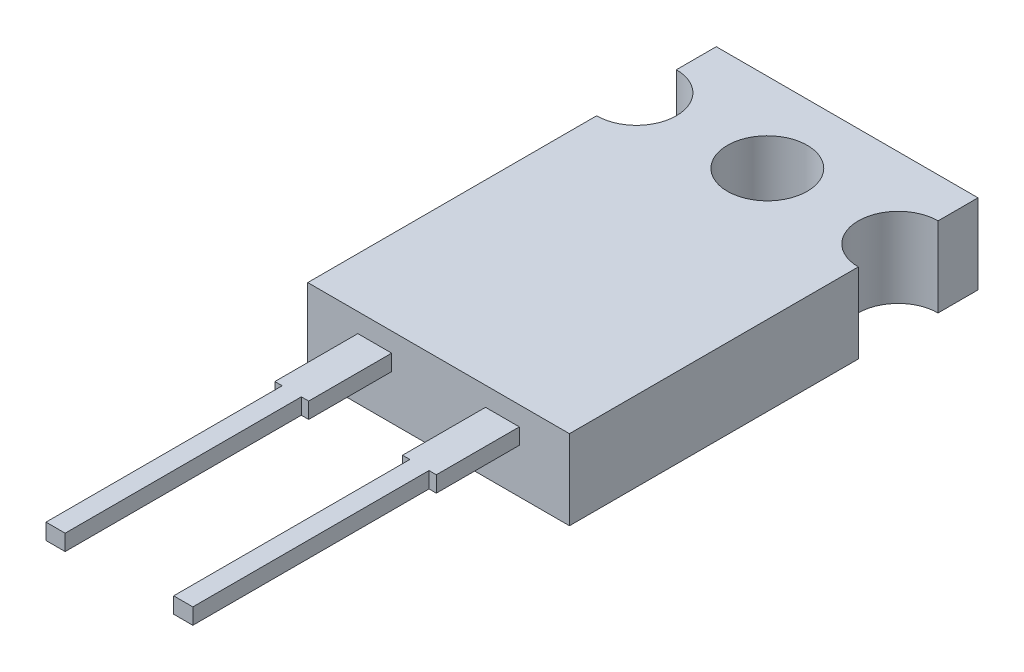
ISO-10303-21;
HEADER;
FILE_DESCRIPTION(('STEP AP214'),'2;1');
FILE_NAME('part.step','',(''),(''),'','','');
FILE_SCHEMA(('AUTOMOTIVE_DESIGN { 1 0 10303 214 1 1 1 1 }'));
ENDSEC;
DATA;
#1=APPLICATION_CONTEXT('core data for automotive mechanical design processes');
#2=APPLICATION_PROTOCOL_DEFINITION('international standard','automotive_design',2000,#1);
#3=PRODUCT_CONTEXT('',#1,'mechanical');
#4=PRODUCT('Part','Part','',(#3));
#5=PRODUCT_RELATED_PRODUCT_CATEGORY('part','',(#4));
#6=PRODUCT_DEFINITION_FORMATION('','',#4);
#7=PRODUCT_DEFINITION_CONTEXT('part definition',#1,'design');
#8=PRODUCT_DEFINITION('design','',#6,#7);
#9=PRODUCT_DEFINITION_SHAPE('','',#8);
#10=(LENGTH_UNIT() NAMED_UNIT(*) SI_UNIT(.MILLI.,.METRE.));
#11=(NAMED_UNIT(*) PLANE_ANGLE_UNIT() SI_UNIT($,.RADIAN.));
#12=(NAMED_UNIT(*) SI_UNIT($,.STERADIAN.) SOLID_ANGLE_UNIT());
#13=UNCERTAINTY_MEASURE_WITH_UNIT(LENGTH_MEASURE(1.E-05),#10,'distance_accuracy_value','');
#14=(GEOMETRIC_REPRESENTATION_CONTEXT(3) GLOBAL_UNCERTAINTY_ASSIGNED_CONTEXT((#13)) GLOBAL_UNIT_ASSIGNED_CONTEXT((#10,
#11,#12)) REPRESENTATION_CONTEXT('',''));
#15=CARTESIAN_POINT('',(0.,0.,0.));
#16=DIRECTION('',(0.,0.,1.));
#17=DIRECTION('',(1.,0.,0.));
#18=AXIS2_PLACEMENT_3D('',#15,#16,#17);
#19=CARTESIAN_POINT('',(0.,3.175,0.));
#20=DIRECTION('',(0.,0.,-1.));
#21=DIRECTION('',(-1.,0.,0.));
#22=AXIS2_PLACEMENT_3D('',#19,#20,#21);
#23=PLANE('',#22);
#24=DIRECTION('',(0.,1.,0.));
#25=VECTOR('',#24,1.);
#26=CARTESIAN_POINT('',(8.4201,1.778,0.));
#27=LINE('',#26,#25);
#28=CARTESIAN_POINT('',(8.4201,1.778,0.));
#29=VERTEX_POINT('',#28);
#30=CARTESIAN_POINT('',(8.4201,2.413,0.));
#31=VERTEX_POINT('',#30);
#32=EDGE_CURVE('E265',#29,#31,#27,.T.);
#33=ORIENTED_EDGE('',*,*,#32,.F.);
#34=DIRECTION('',(1.,0.,0.));
#35=VECTOR('',#34,1.);
#36=CARTESIAN_POINT('',(8.4201,1.778,0.));
#37=LINE('',#36,#35);
#38=CARTESIAN_POINT('',(7.0739,1.778,0.));
#39=VERTEX_POINT('',#38);
#40=EDGE_CURVE('E271',#39,#29,#37,.T.);
#41=ORIENTED_EDGE('',*,*,#40,.F.);
#42=DIRECTION('',(0.,-1.,0.));
#43=VECTOR('',#42,1.);
#44=CARTESIAN_POINT('',(7.0739,1.778,0.));
#45=LINE('',#44,#43);
#46=CARTESIAN_POINT('',(7.0739,2.413,0.));
#47=VERTEX_POINT('',#46);
#48=EDGE_CURVE('E283',#47,#39,#45,.T.);
#49=ORIENTED_EDGE('',*,*,#48,.F.);
#50=DIRECTION('',(-1.,0.,0.));
#51=VECTOR('',#50,1.);
#52=CARTESIAN_POINT('',(8.4201,2.413,0.));
#53=LINE('',#52,#51);
#54=EDGE_CURVE('E279',#31,#47,#53,.T.);
#55=ORIENTED_EDGE('',*,*,#54,.F.);
#56=EDGE_LOOP('',(#33,#41,#49,#55));
#57=FACE_BOUND('',#56,.T.);
#58=DIRECTION('',(1.,0.,0.));
#59=VECTOR('',#58,1.);
#60=CARTESIAN_POINT('',(0.,0.,0.));
#61=LINE('',#60,#59);
#62=CARTESIAN_POINT('',(0.,0.,0.));
#63=VERTEX_POINT('',#62);
#64=CARTESIAN_POINT('',(10.414,0.,0.));
#65=VERTEX_POINT('',#64);
#66=EDGE_CURVE('E333',#63,#65,#61,.T.);
#67=ORIENTED_EDGE('',*,*,#66,.T.);
#68=DIRECTION('',(0.,-1.,0.));
#69=VECTOR('',#68,1.);
#70=CARTESIAN_POINT('',(10.414,3.175,0.));
#71=LINE('',#70,#69);
#72=CARTESIAN_POINT('',(10.414,3.175,0.));
#73=VERTEX_POINT('',#72);
#74=EDGE_CURVE('E380',#73,#65,#71,.T.);
#75=ORIENTED_EDGE('',*,*,#74,.F.);
#76=DIRECTION('',(1.,0.,0.));
#77=VECTOR('',#76,1.);
#78=CARTESIAN_POINT('',(0.,3.175,0.));
#79=LINE('',#78,#77);
#80=CARTESIAN_POINT('',(0.,3.175,0.));
#81=VERTEX_POINT('',#80);
#82=EDGE_CURVE('E334',#81,#73,#79,.T.);
#83=ORIENTED_EDGE('',*,*,#82,.F.);
#84=DIRECTION('',(0.,-1.,0.));
#85=VECTOR('',#84,1.);
#86=CARTESIAN_POINT('',(0.,3.175,0.));
#87=LINE('',#86,#85);
#88=EDGE_CURVE('E353',#81,#63,#87,.T.);
#89=ORIENTED_EDGE('',*,*,#88,.T.);
#90=EDGE_LOOP('',(#67,#75,#83,#89));
#91=FACE_BOUND('',#90,.T.);
#92=DIRECTION('',(0.,1.,0.));
#93=VECTOR('',#92,1.);
#94=CARTESIAN_POINT('',(3.3401,1.778,0.));
#95=LINE('',#94,#93);
#96=CARTESIAN_POINT('',(3.3401,1.778,0.));
#97=VERTEX_POINT('',#96);
#98=CARTESIAN_POINT('',(3.3401,2.413,0.));
#99=VERTEX_POINT('',#98);
#100=EDGE_CURVE('E243',#97,#99,#95,.T.);
#101=ORIENTED_EDGE('',*,*,#100,.F.);
#102=DIRECTION('',(1.,0.,0.));
#103=VECTOR('',#102,1.);
#104=CARTESIAN_POINT('',(3.3401,1.778,0.));
#105=LINE('',#104,#103);
#106=CARTESIAN_POINT('',(1.9939,1.778,0.));
#107=VERTEX_POINT('',#106);
#108=EDGE_CURVE('E231',#107,#97,#105,.T.);
#109=ORIENTED_EDGE('',*,*,#108,.F.);
#110=DIRECTION('',(0.,-1.,0.));
#111=VECTOR('',#110,1.);
#112=CARTESIAN_POINT('',(1.9939,1.778,0.));
#113=LINE('',#112,#111);
#114=CARTESIAN_POINT('',(1.9939,2.413,0.));
#115=VERTEX_POINT('',#114);
#116=EDGE_CURVE('E238',#115,#107,#113,.T.);
#117=ORIENTED_EDGE('',*,*,#116,.F.);
#118=DIRECTION('',(-1.,0.,0.));
#119=VECTOR('',#118,1.);
#120=CARTESIAN_POINT('',(3.3401,2.413,0.));
#121=LINE('',#120,#119);
#122=EDGE_CURVE('E247',#99,#115,#121,.T.);
#123=ORIENTED_EDGE('',*,*,#122,.F.);
#124=EDGE_LOOP('',(#101,#109,#117,#123));
#125=FACE_BOUND('',#124,.T.);
#126=ADVANCED_FACE('F39',(#57,#91,#125),#23,.F.);
#127=CARTESIAN_POINT('',(10.414,3.175,0.));
#128=DIRECTION('',(-1.,0.,0.));
#129=DIRECTION('',(0.,0.,1.));
#130=AXIS2_PLACEMENT_3D('',#127,#128,#129);
#131=PLANE('',#130);
#132=DIRECTION('',(0.,0.,-1.));
#133=VECTOR('',#132,1.);
#134=CARTESIAN_POINT('',(10.414,0.,0.));
#135=LINE('',#134,#133);
#136=CARTESIAN_POINT('',(10.414,0.,-11.4935));
#137=VERTEX_POINT('',#136);
#138=EDGE_CURVE('E358',#65,#137,#135,.T.);
#139=ORIENTED_EDGE('',*,*,#138,.T.);
#140=DIRECTION('',(0.,1.,0.));
#141=VECTOR('',#140,1.);
#142=CARTESIAN_POINT('',(10.414,0.,-11.4935));
#143=LINE('',#142,#141);
#144=CARTESIAN_POINT('',(10.414,3.175,-11.4935));
#145=VERTEX_POINT('',#144);
#146=EDGE_CURVE('E323',#137,#145,#143,.T.);
#147=ORIENTED_EDGE('',*,*,#146,.T.);
#148=DIRECTION('',(0.,0.,-1.));
#149=VECTOR('',#148,1.);
#150=CARTESIAN_POINT('',(10.414,3.175,0.));
#151=LINE('',#150,#149);
#152=EDGE_CURVE('E340',#73,#145,#151,.T.);
#153=ORIENTED_EDGE('',*,*,#152,.F.);
#154=ORIENTED_EDGE('',*,*,#74,.T.);
#155=EDGE_LOOP('',(#139,#147,#153,#154));
#156=FACE_BOUND('',#155,.T.);
#157=ADVANCED_FACE('F488',(#156),#131,.F.);
#158=CARTESIAN_POINT('',(0.,3.175,0.));
#159=DIRECTION('',(-1.,0.,0.));
#160=DIRECTION('',(0.,0.,1.));
#161=AXIS2_PLACEMENT_3D('',#158,#159,#160);
#162=PLANE('',#161);
#163=DIRECTION('',(0.,1.,0.));
#164=VECTOR('',#163,1.);
#165=CARTESIAN_POINT('',(0.,0.,-11.4935));
#166=LINE('',#165,#164);
#167=CARTESIAN_POINT('',(0.,0.,-11.4935));
#168=VERTEX_POINT('',#167);
#169=CARTESIAN_POINT('',(0.,3.175,-11.4935));
#170=VERTEX_POINT('',#169);
#171=EDGE_CURVE('E330',#168,#170,#166,.T.);
#172=ORIENTED_EDGE('',*,*,#171,.F.);
#173=DIRECTION('',(0.,0.,-1.));
#174=VECTOR('',#173,1.);
#175=CARTESIAN_POINT('',(0.,0.,0.));
#176=LINE('',#175,#174);
#177=EDGE_CURVE('E339',#63,#168,#176,.T.);
#178=ORIENTED_EDGE('',*,*,#177,.F.);
#179=ORIENTED_EDGE('',*,*,#88,.F.);
#180=DIRECTION('',(0.,0.,-1.));
#181=VECTOR('',#180,1.);
#182=CARTESIAN_POINT('',(0.,3.175,0.));
#183=LINE('',#182,#181);
#184=EDGE_CURVE('E349',#81,#170,#183,.T.);
#185=ORIENTED_EDGE('',*,*,#184,.T.);
#186=EDGE_LOOP('',(#172,#178,#179,#185));
#187=FACE_BOUND('',#186,.T.);
#188=ADVANCED_FACE('F492',(#187),#162,.T.);
#189=CARTESIAN_POINT('',(10.414,3.175,-14.6685));
#190=VERTEX_POINT('',#189);
#191=CARTESIAN_POINT('',(10.414,3.175,-16.256));
#192=VERTEX_POINT('',#191);
#193=EDGE_CURVE('E338',#190,#192,#151,.T.);
#194=ORIENTED_EDGE('',*,*,#193,.F.);
#195=DIRECTION('',(0.,1.,0.));
#196=VECTOR('',#195,1.);
#197=CARTESIAN_POINT('',(10.414,0.,-14.6685));
#198=LINE('',#197,#196);
#199=CARTESIAN_POINT('',(10.414,0.,-14.6685));
#200=VERTEX_POINT('',#199);
#201=EDGE_CURVE('E316',#190,#200,#198,.F.);
#202=ORIENTED_EDGE('',*,*,#201,.T.);
#203=CARTESIAN_POINT('',(10.414,0.,-16.256));
#204=VERTEX_POINT('',#203);
#205=EDGE_CURVE('E357',#200,#204,#135,.T.);
#206=ORIENTED_EDGE('',*,*,#205,.T.);
#207=DIRECTION('',(0.,-1.,0.));
#208=VECTOR('',#207,1.);
#209=CARTESIAN_POINT('',(10.414,3.175,-16.256));
#210=LINE('',#209,#208);
#211=EDGE_CURVE('E376',#192,#204,#210,.T.);
#212=ORIENTED_EDGE('',*,*,#211,.F.);
#213=EDGE_LOOP('',(#194,#202,#206,#212));
#214=FACE_BOUND('',#213,.T.);
#215=ADVANCED_FACE('F494',(#214),#131,.F.);
#216=CARTESIAN_POINT('',(0.,3.175,-16.256));
#217=DIRECTION('',(0.,0.,-1.));
#218=DIRECTION('',(-1.,0.,0.));
#219=AXIS2_PLACEMENT_3D('',#216,#217,#218);
#220=PLANE('',#219);
#221=DIRECTION('',(1.,0.,0.));
#222=VECTOR('',#221,1.);
#223=CARTESIAN_POINT('',(0.,0.,-16.256));
#224=LINE('',#223,#222);
#225=CARTESIAN_POINT('',(0.,0.,-16.256));
#226=VERTEX_POINT('',#225);
#227=EDGE_CURVE('E362',#226,#204,#224,.T.);
#228=ORIENTED_EDGE('',*,*,#227,.F.);
#229=DIRECTION('',(0.,-1.,0.));
#230=VECTOR('',#229,1.);
#231=CARTESIAN_POINT('',(0.,3.175,-16.256));
#232=LINE('',#231,#230);
#233=CARTESIAN_POINT('',(0.,3.175,-16.256));
#234=VERTEX_POINT('',#233);
#235=EDGE_CURVE('E372',#234,#226,#232,.T.);
#236=ORIENTED_EDGE('',*,*,#235,.F.);
#237=DIRECTION('',(1.,0.,0.));
#238=VECTOR('',#237,1.);
#239=CARTESIAN_POINT('',(0.,3.175,-16.256));
#240=LINE('',#239,#238);
#241=EDGE_CURVE('E344',#234,#192,#240,.T.);
#242=ORIENTED_EDGE('',*,*,#241,.T.);
#243=ORIENTED_EDGE('',*,*,#211,.T.);
#244=EDGE_LOOP('',(#228,#236,#242,#243));
#245=FACE_BOUND('',#244,.T.);
#246=ADVANCED_FACE('F503',(#245),#220,.T.);
#247=DIRECTION('',(0.,1.,0.));
#248=VECTOR('',#247,1.);
#249=CARTESIAN_POINT('',(0.,0.,-14.6685));
#250=LINE('',#249,#248);
#251=CARTESIAN_POINT('',(0.,3.175,-14.6685));
#252=VERTEX_POINT('',#251);
#253=CARTESIAN_POINT('',(0.,0.,-14.6685));
#254=VERTEX_POINT('',#253);
#255=EDGE_CURVE('E327',#252,#254,#250,.F.);
#256=ORIENTED_EDGE('',*,*,#255,.F.);
#257=EDGE_CURVE('E348',#252,#234,#183,.T.);
#258=ORIENTED_EDGE('',*,*,#257,.T.);
#259=ORIENTED_EDGE('',*,*,#235,.T.);
#260=EDGE_CURVE('E366',#254,#226,#176,.T.);
#261=ORIENTED_EDGE('',*,*,#260,.F.);
#262=EDGE_LOOP('',(#256,#258,#259,#261));
#263=FACE_BOUND('',#262,.T.);
#264=ADVANCED_FACE('F500',(#263),#162,.T.);
#265=CARTESIAN_POINT('',(0.,3.175,0.));
#266=DIRECTION('',(0.,1.,0.));
#267=DIRECTION('',(0.,0.,1.));
#268=AXIS2_PLACEMENT_3D('',#265,#266,#267);
#269=PLANE('',#268);
#270=CARTESIAN_POINT('',(0.,3.175,-13.081));
#271=DIRECTION('',(0.,1.,0.));
#272=DIRECTION('',(0.,0.,1.));
#273=AXIS2_PLACEMENT_3D('',#270,#271,#272);
#274=CIRCLE('',#273,1.5875);
#275=EDGE_CURVE('E301',#170,#252,#274,.T.);
#276=ORIENTED_EDGE('',*,*,#275,.F.);
#277=ORIENTED_EDGE('',*,*,#184,.F.);
#278=ORIENTED_EDGE('',*,*,#82,.T.);
#279=ORIENTED_EDGE('',*,*,#152,.T.);
#280=CARTESIAN_POINT('',(10.414,3.175,-13.081));
#281=DIRECTION('',(0.,1.,0.));
#282=DIRECTION('',(0.,0.,1.));
#283=AXIS2_PLACEMENT_3D('',#280,#281,#282);
#284=CIRCLE('',#283,1.5875);
#285=EDGE_CURVE('E302',#190,#145,#284,.T.);
#286=ORIENTED_EDGE('',*,*,#285,.F.);
#287=ORIENTED_EDGE('',*,*,#193,.T.);
#288=ORIENTED_EDGE('',*,*,#241,.F.);
#289=ORIENTED_EDGE('',*,*,#257,.F.);
#290=EDGE_LOOP('',(#276,#277,#278,#279,#286,#287,#288,#289));
#291=FACE_BOUND('',#290,.T.);
#292=CARTESIAN_POINT('',(5.207,3.175,-13.081));
#293=DIRECTION('',(0.,1.,0.));
#294=DIRECTION('',(0.,0.,1.));
#295=AXIS2_PLACEMENT_3D('',#292,#293,#294);
#296=CIRCLE('',#295,1.5875);
#297=CARTESIAN_POINT('',(5.207,3.175,-11.4935));
#298=VERTEX_POINT('',#297);
#299=EDGE_CURVE('E305',#298,#298,#296,.T.);
#300=ORIENTED_EDGE('',*,*,#299,.F.);
#301=EDGE_LOOP('',(#300));
#302=FACE_BOUND('',#301,.T.);
#303=ADVANCED_FACE('F527',(#291,#302),#269,.T.);
#304=CARTESIAN_POINT('',(0.,0.,0.));
#305=DIRECTION('',(0.,1.,0.));
#306=DIRECTION('',(0.,0.,1.));
#307=AXIS2_PLACEMENT_3D('',#304,#305,#306);
#308=PLANE('',#307);
#309=CARTESIAN_POINT('',(5.207,0.,-13.081));
#310=DIRECTION('',(0.,1.,0.));
#311=DIRECTION('',(0.,0.,1.));
#312=AXIS2_PLACEMENT_3D('',#309,#310,#311);
#313=CIRCLE('',#312,1.5875);
#314=CARTESIAN_POINT('',(5.207,0.,-11.4935));
#315=VERTEX_POINT('',#314);
#316=EDGE_CURVE('E312',#315,#315,#313,.T.);
#317=ORIENTED_EDGE('',*,*,#316,.T.);
#318=EDGE_LOOP('',(#317));
#319=FACE_BOUND('',#318,.T.);
#320=ORIENTED_EDGE('',*,*,#177,.T.);
#321=CARTESIAN_POINT('',(0.,0.,-13.081));
#322=DIRECTION('',(0.,1.,0.));
#323=DIRECTION('',(0.,0.,1.));
#324=AXIS2_PLACEMENT_3D('',#321,#322,#323);
#325=CIRCLE('',#324,1.5875);
#326=EDGE_CURVE('E306',#168,#254,#325,.T.);
#327=ORIENTED_EDGE('',*,*,#326,.T.);
#328=ORIENTED_EDGE('',*,*,#260,.T.);
#329=ORIENTED_EDGE('',*,*,#227,.T.);
#330=ORIENTED_EDGE('',*,*,#205,.F.);
#331=CARTESIAN_POINT('',(10.414,0.,-13.081));
#332=DIRECTION('',(0.,1.,0.));
#333=DIRECTION('',(0.,0.,1.));
#334=AXIS2_PLACEMENT_3D('',#331,#332,#333);
#335=CIRCLE('',#334,1.5875);
#336=EDGE_CURVE('E384',#200,#137,#335,.T.);
#337=ORIENTED_EDGE('',*,*,#336,.T.);
#338=ORIENTED_EDGE('',*,*,#138,.F.);
#339=ORIENTED_EDGE('',*,*,#66,.F.);
#340=EDGE_LOOP('',(#320,#327,#328,#329,#330,#337,#338,#339));
#341=FACE_BOUND('',#340,.T.);
#342=ADVANCED_FACE('F521',(#319,#341),#308,.F.);
#343=CARTESIAN_POINT('',(5.207,0.,-13.081));
#344=DIRECTION('',(0.,1.,0.));
#345=DIRECTION('',(0.,0.,1.));
#346=AXIS2_PLACEMENT_3D('',#343,#344,#345);
#347=CYLINDRICAL_SURFACE('',#346,1.5875);
#348=ORIENTED_EDGE('',*,*,#316,.F.);
#349=EDGE_LOOP('',(#348));
#350=FACE_BOUND('',#349,.T.);
#351=ORIENTED_EDGE('',*,*,#299,.T.);
#352=EDGE_LOOP('',(#351));
#353=FACE_BOUND('',#352,.T.);
#354=ADVANCED_FACE('F542',(#350,#353),#347,.F.);
#355=CARTESIAN_POINT('',(10.414,0.,-13.081));
#356=DIRECTION('',(0.,1.,0.));
#357=DIRECTION('',(0.,0.,1.));
#358=AXIS2_PLACEMENT_3D('',#355,#356,#357);
#359=CYLINDRICAL_SURFACE('',#358,1.5875);
#360=ORIENTED_EDGE('',*,*,#336,.F.);
#361=ORIENTED_EDGE('',*,*,#201,.F.);
#362=ORIENTED_EDGE('',*,*,#285,.T.);
#363=ORIENTED_EDGE('',*,*,#146,.F.);
#364=EDGE_LOOP('',(#360,#361,#362,#363));
#365=FACE_BOUND('',#364,.T.);
#366=ADVANCED_FACE('F539',(#365),#359,.F.);
#367=CARTESIAN_POINT('',(0.,0.,-13.081));
#368=DIRECTION('',(0.,1.,0.));
#369=DIRECTION('',(0.,0.,1.));
#370=AXIS2_PLACEMENT_3D('',#367,#368,#369);
#371=CYLINDRICAL_SURFACE('',#370,1.5875);
#372=ORIENTED_EDGE('',*,*,#171,.T.);
#373=ORIENTED_EDGE('',*,*,#275,.T.);
#374=ORIENTED_EDGE('',*,*,#255,.T.);
#375=ORIENTED_EDGE('',*,*,#326,.F.);
#376=EDGE_LOOP('',(#372,#373,#374,#375));
#377=FACE_BOUND('',#376,.T.);
#378=ADVANCED_FACE('F541',(#377),#371,.F.);
#379=CARTESIAN_POINT('',(8.4201,1.778,12.7));
#380=DIRECTION('',(-1.,0.,0.));
#381=DIRECTION('',(0.,0.,1.));
#382=AXIS2_PLACEMENT_3D('',#379,#380,#381);
#383=PLANE('',#382);
#384=DIRECTION('',(0.,0.,-1.));
#385=VECTOR('',#384,1.);
#386=CARTESIAN_POINT('',(8.4201,2.413,12.7));
#387=LINE('',#386,#385);
#388=CARTESIAN_POINT('',(8.4201,2.413,3.302));
#389=VERTEX_POINT('',#388);
#390=EDGE_CURVE('E298',#389,#31,#387,.T.);
#391=ORIENTED_EDGE('',*,*,#390,.F.);
#392=DIRECTION('',(0.,1.,0.));
#393=VECTOR('',#392,1.);
#394=CARTESIAN_POINT('',(8.4201,0.,3.302));
#395=LINE('',#394,#393);
#396=CARTESIAN_POINT('',(8.4201,1.778,3.302));
#397=VERTEX_POINT('',#396);
#398=EDGE_CURVE('E415',#397,#389,#395,.T.);
#399=ORIENTED_EDGE('',*,*,#398,.F.);
#400=DIRECTION('',(0.,0.,-1.));
#401=VECTOR('',#400,1.);
#402=CARTESIAN_POINT('',(8.4201,1.778,12.7));
#403=LINE('',#402,#401);
#404=EDGE_CURVE('E275',#397,#29,#403,.T.);
#405=ORIENTED_EDGE('',*,*,#404,.T.);
#406=ORIENTED_EDGE('',*,*,#32,.T.);
#407=EDGE_LOOP('',(#391,#399,#405,#406));
#408=FACE_BOUND('',#407,.T.);
#409=ADVANCED_FACE('F420',(#408),#383,.F.);
#410=CARTESIAN_POINT('',(8.4201,2.413,12.7));
#411=DIRECTION('',(0.,-1.,0.));
#412=DIRECTION('',(1.,0.,0.));
#413=AXIS2_PLACEMENT_3D('',#410,#411,#412);
#414=PLANE('',#413);
#415=DIRECTION('',(0.,0.,-1.));
#416=VECTOR('',#415,1.);
#417=CARTESIAN_POINT('',(7.0739,2.413,12.7));
#418=LINE('',#417,#416);
#419=CARTESIAN_POINT('',(7.0739,2.413,3.302));
#420=VERTEX_POINT('',#419);
#421=EDGE_CURVE('E295',#420,#47,#418,.T.);
#422=ORIENTED_EDGE('',*,*,#421,.F.);
#423=DIRECTION('',(-1.,0.,0.));
#424=VECTOR('',#423,1.);
#425=CARTESIAN_POINT('',(7.0739,2.413,3.302));
#426=LINE('',#425,#424);
#427=CARTESIAN_POINT('',(7.366,2.413,3.302));
#428=VERTEX_POINT('',#427);
#429=EDGE_CURVE('E450',#428,#420,#426,.T.);
#430=ORIENTED_EDGE('',*,*,#429,.F.);
#431=DIRECTION('',(0.,0.,-1.));
#432=VECTOR('',#431,1.);
#433=CARTESIAN_POINT('',(7.366,2.413,12.7));
#434=LINE('',#433,#432);
#435=CARTESIAN_POINT('',(7.366,2.413,12.7));
#436=VERTEX_POINT('',#435);
#437=EDGE_CURVE('E426',#436,#428,#434,.T.);
#438=ORIENTED_EDGE('',*,*,#437,.F.);
#439=DIRECTION('',(-1.,0.,0.));
#440=VECTOR('',#439,1.);
#441=CARTESIAN_POINT('',(8.4201,2.413,12.7));
#442=LINE('',#441,#440);
#443=CARTESIAN_POINT('',(8.128,2.413,12.7));
#444=VERTEX_POINT('',#443);
#445=EDGE_CURVE('E266',#444,#436,#442,.T.);
#446=ORIENTED_EDGE('',*,*,#445,.F.);
#447=DIRECTION('',(0.,0.,1.));
#448=VECTOR('',#447,1.);
#449=CARTESIAN_POINT('',(8.128,2.413,12.7));
#450=LINE('',#449,#448);
#451=CARTESIAN_POINT('',(8.128,2.413,3.302));
#452=VERTEX_POINT('',#451);
#453=EDGE_CURVE('E62',#452,#444,#450,.T.);
#454=ORIENTED_EDGE('',*,*,#453,.F.);
#455=DIRECTION('',(-1.,0.,0.));
#456=VECTOR('',#455,1.);
#457=CARTESIAN_POINT('',(8.4201,2.413,3.302));
#458=LINE('',#457,#456);
#459=EDGE_CURVE('E428',#389,#452,#458,.T.);
#460=ORIENTED_EDGE('',*,*,#459,.F.);
#461=ORIENTED_EDGE('',*,*,#390,.T.);
#462=ORIENTED_EDGE('',*,*,#54,.T.);
#463=EDGE_LOOP('',(#422,#430,#438,#446,#454,#460,#461,#462));
#464=FACE_BOUND('',#463,.T.);
#465=ADVANCED_FACE('F449',(#464),#414,.F.);
#466=CARTESIAN_POINT('',(7.0739,1.778,12.7));
#467=DIRECTION('',(1.,0.,0.));
#468=DIRECTION('',(0.,0.,-1.));
#469=AXIS2_PLACEMENT_3D('',#466,#467,#468);
#470=PLANE('',#469);
#471=DIRECTION('',(0.,0.,-1.));
#472=VECTOR('',#471,1.);
#473=CARTESIAN_POINT('',(7.0739,1.778,12.7));
#474=LINE('',#473,#472);
#475=CARTESIAN_POINT('',(7.0739,1.778,3.302));
#476=VERTEX_POINT('',#475);
#477=EDGE_CURVE('E292',#476,#39,#474,.T.);
#478=ORIENTED_EDGE('',*,*,#477,.F.);
#479=DIRECTION('',(0.,1.,0.));
#480=VECTOR('',#479,1.);
#481=CARTESIAN_POINT('',(7.0739,0.,3.302));
#482=LINE('',#481,#480);
#483=EDGE_CURVE('E460',#476,#420,#482,.T.);
#484=ORIENTED_EDGE('',*,*,#483,.T.);
#485=ORIENTED_EDGE('',*,*,#421,.T.);
#486=ORIENTED_EDGE('',*,*,#48,.T.);
#487=EDGE_LOOP('',(#478,#484,#485,#486));
#488=FACE_BOUND('',#487,.T.);
#489=ADVANCED_FACE('F474',(#488),#470,.F.);
#490=CARTESIAN_POINT('',(8.4201,1.778,12.7));
#491=DIRECTION('',(0.,1.,0.));
#492=DIRECTION('',(-1.,0.,0.));
#493=AXIS2_PLACEMENT_3D('',#490,#491,#492);
#494=PLANE('',#493);
#495=DIRECTION('',(0.,0.,-1.));
#496=VECTOR('',#495,1.);
#497=CARTESIAN_POINT('',(7.366,1.778,12.7));
#498=LINE('',#497,#496);
#499=CARTESIAN_POINT('',(7.366,1.778,12.7));
#500=VERTEX_POINT('',#499);
#501=CARTESIAN_POINT('',(7.366,1.778,3.302));
#502=VERTEX_POINT('',#501);
#503=EDGE_CURVE('E54',#500,#502,#498,.T.);
#504=ORIENTED_EDGE('',*,*,#503,.T.);
#505=DIRECTION('',(-1.,0.,0.));
#506=VECTOR('',#505,1.);
#507=CARTESIAN_POINT('',(8.4201,1.778,3.302));
#508=LINE('',#507,#506);
#509=EDGE_CURVE('E11',#502,#476,#508,.T.);
#510=ORIENTED_EDGE('',*,*,#509,.T.);
#511=ORIENTED_EDGE('',*,*,#477,.T.);
#512=ORIENTED_EDGE('',*,*,#40,.T.);
#513=ORIENTED_EDGE('',*,*,#404,.F.);
#514=DIRECTION('',(-1.,0.,0.));
#515=VECTOR('',#514,1.);
#516=CARTESIAN_POINT('',(8.4201,1.778,3.302));
#517=LINE('',#516,#515);
#518=CARTESIAN_POINT('',(8.128,1.778,3.302));
#519=VERTEX_POINT('',#518);
#520=EDGE_CURVE('E47',#397,#519,#517,.T.);
#521=ORIENTED_EDGE('',*,*,#520,.T.);
#522=DIRECTION('',(0.,0.,1.));
#523=VECTOR('',#522,1.);
#524=CARTESIAN_POINT('',(8.128,1.778,12.7));
#525=LINE('',#524,#523);
#526=CARTESIAN_POINT('',(8.128,1.778,12.7));
#527=VERTEX_POINT('',#526);
#528=EDGE_CURVE('E409',#519,#527,#525,.T.);
#529=ORIENTED_EDGE('',*,*,#528,.T.);
#530=DIRECTION('',(1.,0.,0.));
#531=VECTOR('',#530,1.);
#532=CARTESIAN_POINT('',(8.4201,1.778,12.7));
#533=LINE('',#532,#531);
#534=EDGE_CURVE('E270',#500,#527,#533,.T.);
#535=ORIENTED_EDGE('',*,*,#534,.F.);
#536=EDGE_LOOP('',(#504,#510,#511,#512,#513,#521,#529,#535));
#537=FACE_BOUND('',#536,.T.);
#538=ADVANCED_FACE('F407',(#537),#494,.F.);
#539=CARTESIAN_POINT('',(0.,0.,12.7));
#540=DIRECTION('',(0.,0.,1.));
#541=DIRECTION('',(1.,0.,0.));
#542=AXIS2_PLACEMENT_3D('',#539,#540,#541);
#543=PLANE('',#542);
#544=DIRECTION('',(0.,1.,0.));
#545=VECTOR('',#544,1.);
#546=CARTESIAN_POINT('',(7.366,0.,12.7));
#547=LINE('',#546,#545);
#548=EDGE_CURVE('E400',#500,#436,#547,.T.);
#549=ORIENTED_EDGE('',*,*,#548,.F.);
#550=ORIENTED_EDGE('',*,*,#534,.T.);
#551=DIRECTION('',(0.,-1.,0.));
#552=VECTOR('',#551,1.);
#553=CARTESIAN_POINT('',(8.128,0.,12.7));
#554=LINE('',#553,#552);
#555=EDGE_CURVE('E397',#444,#527,#554,.T.);
#556=ORIENTED_EDGE('',*,*,#555,.F.);
#557=ORIENTED_EDGE('',*,*,#445,.T.);
#558=EDGE_LOOP('',(#549,#550,#556,#557));
#559=FACE_BOUND('',#558,.T.);
#560=ADVANCED_FACE('F441',(#559),#543,.T.);
#561=CARTESIAN_POINT('',(3.3401,1.778,12.7));
#562=DIRECTION('',(-1.,0.,0.));
#563=DIRECTION('',(0.,0.,1.));
#564=AXIS2_PLACEMENT_3D('',#561,#562,#563);
#565=PLANE('',#564);
#566=DIRECTION('',(0.,0.,-1.));
#567=VECTOR('',#566,1.);
#568=CARTESIAN_POINT('',(3.3401,2.413,12.7));
#569=LINE('',#568,#567);
#570=CARTESIAN_POINT('',(3.3401,2.413,3.302));
#571=VERTEX_POINT('',#570);
#572=EDGE_CURVE('E262',#571,#99,#569,.T.);
#573=ORIENTED_EDGE('',*,*,#572,.F.);
#574=DIRECTION('',(0.,1.,0.));
#575=VECTOR('',#574,1.);
#576=CARTESIAN_POINT('',(3.3401,0.,3.302));
#577=LINE('',#576,#575);
#578=CARTESIAN_POINT('',(3.3401,1.778,3.302));
#579=VERTEX_POINT('',#578);
#580=EDGE_CURVE('E457',#579,#571,#577,.T.);
#581=ORIENTED_EDGE('',*,*,#580,.F.);
#582=DIRECTION('',(0.,0.,-1.));
#583=VECTOR('',#582,1.);
#584=CARTESIAN_POINT('',(3.3401,1.778,12.7));
#585=LINE('',#584,#583);
#586=EDGE_CURVE('E235',#579,#97,#585,.T.);
#587=ORIENTED_EDGE('',*,*,#586,.T.);
#588=ORIENTED_EDGE('',*,*,#100,.T.);
#589=EDGE_LOOP('',(#573,#581,#587,#588));
#590=FACE_BOUND('',#589,.T.);
#591=ADVANCED_FACE('F629',(#590),#565,.F.);
#592=CARTESIAN_POINT('',(3.3401,2.413,12.7));
#593=DIRECTION('',(0.,-1.,0.));
#594=DIRECTION('',(1.,0.,0.));
#595=AXIS2_PLACEMENT_3D('',#592,#593,#594);
#596=PLANE('',#595);
#597=DIRECTION('',(0.,0.,-1.));
#598=VECTOR('',#597,1.);
#599=CARTESIAN_POINT('',(1.9939,2.413,12.7));
#600=LINE('',#599,#598);
#601=CARTESIAN_POINT('',(1.9939,2.413,3.302));
#602=VERTEX_POINT('',#601);
#603=EDGE_CURVE('E259',#602,#115,#600,.T.);
#604=ORIENTED_EDGE('',*,*,#603,.F.);
#605=DIRECTION('',(-1.,0.,0.));
#606=VECTOR('',#605,1.);
#607=CARTESIAN_POINT('',(1.9939,2.413,3.302));
#608=LINE('',#607,#606);
#609=CARTESIAN_POINT('',(2.286,2.413,3.302));
#610=VERTEX_POINT('',#609);
#611=EDGE_CURVE('E223',#610,#602,#608,.T.);
#612=ORIENTED_EDGE('',*,*,#611,.F.);
#613=DIRECTION('',(0.,0.,-1.));
#614=VECTOR('',#613,1.);
#615=CARTESIAN_POINT('',(2.286,2.413,12.7));
#616=LINE('',#615,#614);
#617=CARTESIAN_POINT('',(2.286,2.413,12.7));
#618=VERTEX_POINT('',#617);
#619=EDGE_CURVE('E205',#618,#610,#616,.T.);
#620=ORIENTED_EDGE('',*,*,#619,.F.);
#621=DIRECTION('',(-1.,0.,0.));
#622=VECTOR('',#621,1.);
#623=CARTESIAN_POINT('',(3.3401,2.413,12.7));
#624=LINE('',#623,#622);
#625=CARTESIAN_POINT('',(3.048,2.413,12.7));
#626=VERTEX_POINT('',#625);
#627=EDGE_CURVE('E222',#626,#618,#624,.T.);
#628=ORIENTED_EDGE('',*,*,#627,.F.);
#629=DIRECTION('',(0.,0.,1.));
#630=VECTOR('',#629,1.);
#631=CARTESIAN_POINT('',(3.048,2.413,12.7));
#632=LINE('',#631,#630);
#633=CARTESIAN_POINT('',(3.048,2.413,3.302));
#634=VERTEX_POINT('',#633);
#635=EDGE_CURVE('E751',#634,#626,#632,.T.);
#636=ORIENTED_EDGE('',*,*,#635,.F.);
#637=DIRECTION('',(-1.,0.,0.));
#638=VECTOR('',#637,1.);
#639=CARTESIAN_POINT('',(3.3401,2.413,3.302));
#640=LINE('',#639,#638);
#641=EDGE_CURVE('E464',#571,#634,#640,.T.);
#642=ORIENTED_EDGE('',*,*,#641,.F.);
#643=ORIENTED_EDGE('',*,*,#572,.T.);
#644=ORIENTED_EDGE('',*,*,#122,.T.);
#645=EDGE_LOOP('',(#604,#612,#620,#628,#636,#642,#643,#644));
#646=FACE_BOUND('',#645,.T.);
#647=ADVANCED_FACE('F220',(#646),#596,.F.);
#648=CARTESIAN_POINT('',(1.9939,1.778,12.7));
#649=DIRECTION('',(1.,0.,0.));
#650=DIRECTION('',(0.,0.,-1.));
#651=AXIS2_PLACEMENT_3D('',#648,#649,#650);
#652=PLANE('',#651);
#653=DIRECTION('',(0.,0.,-1.));
#654=VECTOR('',#653,1.);
#655=CARTESIAN_POINT('',(1.9939,1.778,12.7));
#656=LINE('',#655,#654);
#657=CARTESIAN_POINT('',(1.9939,1.778,3.302));
#658=VERTEX_POINT('',#657);
#659=EDGE_CURVE('E256',#658,#107,#656,.T.);
#660=ORIENTED_EDGE('',*,*,#659,.F.);
#661=DIRECTION('',(0.,1.,0.));
#662=VECTOR('',#661,1.);
#663=CARTESIAN_POINT('',(1.9939,0.,3.302));
#664=LINE('',#663,#662);
#665=EDGE_CURVE('E435',#658,#602,#664,.T.);
#666=ORIENTED_EDGE('',*,*,#665,.T.);
#667=ORIENTED_EDGE('',*,*,#603,.T.);
#668=ORIENTED_EDGE('',*,*,#116,.T.);
#669=EDGE_LOOP('',(#660,#666,#667,#668));
#670=FACE_BOUND('',#669,.T.);
#671=ADVANCED_FACE('F647',(#670),#652,.F.);
#672=CARTESIAN_POINT('',(3.3401,1.778,12.7));
#673=DIRECTION('',(0.,1.,0.));
#674=DIRECTION('',(-1.,0.,0.));
#675=AXIS2_PLACEMENT_3D('',#672,#673,#674);
#676=PLANE('',#675);
#677=DIRECTION('',(0.,0.,-1.));
#678=VECTOR('',#677,1.);
#679=CARTESIAN_POINT('',(2.286,1.778,12.7));
#680=LINE('',#679,#678);
#681=CARTESIAN_POINT('',(2.286,1.778,12.7));
#682=VERTEX_POINT('',#681);
#683=CARTESIAN_POINT('',(2.286,1.778,3.302));
#684=VERTEX_POINT('',#683);
#685=EDGE_CURVE('E208',#682,#684,#680,.T.);
#686=ORIENTED_EDGE('',*,*,#685,.T.);
#687=DIRECTION('',(-1.,0.,0.));
#688=VECTOR('',#687,1.);
#689=CARTESIAN_POINT('',(3.34010000000001,1.778,3.302));
#690=LINE('',#689,#688);
#691=EDGE_CURVE('E393',#684,#658,#690,.T.);
#692=ORIENTED_EDGE('',*,*,#691,.T.);
#693=ORIENTED_EDGE('',*,*,#659,.T.);
#694=ORIENTED_EDGE('',*,*,#108,.T.);
#695=ORIENTED_EDGE('',*,*,#586,.F.);
#696=DIRECTION('',(-1.,0.,0.));
#697=VECTOR('',#696,1.);
#698=CARTESIAN_POINT('',(3.34009999999999,1.778,3.302));
#699=LINE('',#698,#697);
#700=CARTESIAN_POINT('',(3.048,1.778,3.302));
#701=VERTEX_POINT('',#700);
#702=EDGE_CURVE('E214',#579,#701,#699,.T.);
#703=ORIENTED_EDGE('',*,*,#702,.T.);
#704=DIRECTION('',(0.,0.,1.));
#705=VECTOR('',#704,1.);
#706=CARTESIAN_POINT('',(3.048,1.778,12.7));
#707=LINE('',#706,#705);
#708=CARTESIAN_POINT('',(3.048,1.778,12.7));
#709=VERTEX_POINT('',#708);
#710=EDGE_CURVE('E431',#701,#709,#707,.T.);
#711=ORIENTED_EDGE('',*,*,#710,.T.);
#712=DIRECTION('',(1.,0.,0.));
#713=VECTOR('',#712,1.);
#714=CARTESIAN_POINT('',(3.3401,1.778,12.7));
#715=LINE('',#714,#713);
#716=EDGE_CURVE('E230',#682,#709,#715,.T.);
#717=ORIENTED_EDGE('',*,*,#716,.F.);
#718=EDGE_LOOP('',(#686,#692,#693,#694,#695,#703,#711,#717));
#719=FACE_BOUND('',#718,.T.);
#720=ADVANCED_FACE('F656',(#719),#676,.F.);
#721=CARTESIAN_POINT('',(0.,0.,12.7));
#722=DIRECTION('',(0.,0.,1.));
#723=DIRECTION('',(1.,0.,0.));
#724=AXIS2_PLACEMENT_3D('',#721,#722,#723);
#725=PLANE('',#724);
#726=DIRECTION('',(0.,1.,0.));
#727=VECTOR('',#726,1.);
#728=CARTESIAN_POINT('',(2.286,0.,12.7));
#729=LINE('',#728,#727);
#730=EDGE_CURVE('E201',#682,#618,#729,.T.);
#731=ORIENTED_EDGE('',*,*,#730,.F.);
#732=ORIENTED_EDGE('',*,*,#716,.T.);
#733=DIRECTION('',(0.,-1.,0.));
#734=VECTOR('',#733,1.);
#735=CARTESIAN_POINT('',(3.048,0.,12.7));
#736=LINE('',#735,#734);
#737=EDGE_CURVE('E215',#626,#709,#736,.T.);
#738=ORIENTED_EDGE('',*,*,#737,.F.);
#739=ORIENTED_EDGE('',*,*,#627,.T.);
#740=EDGE_LOOP('',(#731,#732,#738,#739));
#741=FACE_BOUND('',#740,.T.);
#742=ADVANCED_FACE('F228',(#741),#725,.T.);
#743=CARTESIAN_POINT('',(3.3401,0.,3.302));
#744=DIRECTION('',(0.,0.,-1.));
#745=DIRECTION('',(-1.,0.,0.));
#746=AXIS2_PLACEMENT_3D('',#743,#744,#745);
#747=PLANE('',#746);
#748=ORIENTED_EDGE('',*,*,#580,.T.);
#749=ORIENTED_EDGE('',*,*,#641,.T.);
#750=DIRECTION('',(0.,1.,0.));
#751=VECTOR('',#750,1.);
#752=CARTESIAN_POINT('',(3.048,0.,3.302));
#753=LINE('',#752,#751);
#754=EDGE_CURVE('E225',#701,#634,#753,.T.);
#755=ORIENTED_EDGE('',*,*,#754,.F.);
#756=ORIENTED_EDGE('',*,*,#702,.F.);
#757=EDGE_LOOP('',(#748,#749,#755,#756));
#758=FACE_BOUND('',#757,.T.);
#759=ADVANCED_FACE('F675',(#758),#747,.F.);
#760=CARTESIAN_POINT('',(3.048,0.,12.7));
#761=DIRECTION('',(-1.,0.,0.));
#762=DIRECTION('',(0.,-1.,0.));
#763=AXIS2_PLACEMENT_3D('',#760,#761,#762);
#764=PLANE('',#763);
#765=ORIENTED_EDGE('',*,*,#754,.T.);
#766=ORIENTED_EDGE('',*,*,#635,.T.);
#767=ORIENTED_EDGE('',*,*,#737,.T.);
#768=ORIENTED_EDGE('',*,*,#710,.F.);
#769=EDGE_LOOP('',(#765,#766,#767,#768));
#770=FACE_BOUND('',#769,.T.);
#771=ADVANCED_FACE('F684',(#770),#764,.F.);
#772=CARTESIAN_POINT('',(1.9939,0.,3.302));
#773=DIRECTION('',(0.,0.,-1.));
#774=DIRECTION('',(-1.,0.,0.));
#775=AXIS2_PLACEMENT_3D('',#772,#773,#774);
#776=PLANE('',#775);
#777=DIRECTION('',(0.,1.,0.));
#778=VECTOR('',#777,1.);
#779=CARTESIAN_POINT('',(2.286,0.,3.302));
#780=LINE('',#779,#778);
#781=EDGE_CURVE('E739',#684,#610,#780,.T.);
#782=ORIENTED_EDGE('',*,*,#781,.T.);
#783=ORIENTED_EDGE('',*,*,#611,.T.);
#784=ORIENTED_EDGE('',*,*,#665,.F.);
#785=ORIENTED_EDGE('',*,*,#691,.F.);
#786=EDGE_LOOP('',(#782,#783,#784,#785));
#787=FACE_BOUND('',#786,.T.);
#788=ADVANCED_FACE('F693',(#787),#776,.F.);
#789=CARTESIAN_POINT('',(2.286,0.,12.7));
#790=DIRECTION('',(1.,0.,0.));
#791=DIRECTION('',(0.,1.,0.));
#792=AXIS2_PLACEMENT_3D('',#789,#790,#791);
#793=PLANE('',#792);
#794=ORIENTED_EDGE('',*,*,#730,.T.);
#795=ORIENTED_EDGE('',*,*,#619,.T.);
#796=ORIENTED_EDGE('',*,*,#781,.F.);
#797=ORIENTED_EDGE('',*,*,#685,.F.);
#798=EDGE_LOOP('',(#794,#795,#796,#797));
#799=FACE_BOUND('',#798,.T.);
#800=ADVANCED_FACE('F203',(#799),#793,.F.);
#801=CARTESIAN_POINT('',(8.4201,0.,3.302));
#802=DIRECTION('',(0.,0.,-1.));
#803=DIRECTION('',(-1.,0.,0.));
#804=AXIS2_PLACEMENT_3D('',#801,#802,#803);
#805=PLANE('',#804);
#806=ORIENTED_EDGE('',*,*,#398,.T.);
#807=ORIENTED_EDGE('',*,*,#459,.T.);
#808=DIRECTION('',(0.,1.,0.));
#809=VECTOR('',#808,1.);
#810=CARTESIAN_POINT('',(8.128,0.,3.302));
#811=LINE('',#810,#809);
#812=EDGE_CURVE('E417',#519,#452,#811,.T.);
#813=ORIENTED_EDGE('',*,*,#812,.F.);
#814=ORIENTED_EDGE('',*,*,#520,.F.);
#815=EDGE_LOOP('',(#806,#807,#813,#814));
#816=FACE_BOUND('',#815,.T.);
#817=ADVANCED_FACE('F413',(#816),#805,.F.);
#818=CARTESIAN_POINT('',(8.128,0.,12.7));
#819=DIRECTION('',(-1.,0.,0.));
#820=DIRECTION('',(0.,-1.,0.));
#821=AXIS2_PLACEMENT_3D('',#818,#819,#820);
#822=PLANE('',#821);
#823=ORIENTED_EDGE('',*,*,#812,.T.);
#824=ORIENTED_EDGE('',*,*,#453,.T.);
#825=ORIENTED_EDGE('',*,*,#555,.T.);
#826=ORIENTED_EDGE('',*,*,#528,.F.);
#827=EDGE_LOOP('',(#823,#824,#825,#826));
#828=FACE_BOUND('',#827,.T.);
#829=ADVANCED_FACE('F478',(#828),#822,.F.);
#830=CARTESIAN_POINT('',(7.0739,0.,3.302));
#831=DIRECTION('',(0.,0.,-1.));
#832=DIRECTION('',(-1.,0.,0.));
#833=AXIS2_PLACEMENT_3D('',#830,#831,#832);
#834=PLANE('',#833);
#835=DIRECTION('',(0.,1.,0.));
#836=VECTOR('',#835,1.);
#837=CARTESIAN_POINT('',(7.366,0.,3.302));
#838=LINE('',#837,#836);
#839=EDGE_CURVE('E454',#502,#428,#838,.T.);
#840=ORIENTED_EDGE('',*,*,#839,.T.);
#841=ORIENTED_EDGE('',*,*,#429,.T.);
#842=ORIENTED_EDGE('',*,*,#483,.F.);
#843=ORIENTED_EDGE('',*,*,#509,.F.);
#844=EDGE_LOOP('',(#840,#841,#842,#843));
#845=FACE_BOUND('',#844,.T.);
#846=ADVANCED_FACE('F476',(#845),#834,.F.);
#847=CARTESIAN_POINT('',(7.366,0.,12.7));
#848=DIRECTION('',(1.,0.,0.));
#849=DIRECTION('',(0.,1.,0.));
#850=AXIS2_PLACEMENT_3D('',#847,#848,#849);
#851=PLANE('',#850);
#852=ORIENTED_EDGE('',*,*,#548,.T.);
#853=ORIENTED_EDGE('',*,*,#437,.T.);
#854=ORIENTED_EDGE('',*,*,#839,.F.);
#855=ORIENTED_EDGE('',*,*,#503,.F.);
#856=EDGE_LOOP('',(#852,#853,#854,#855));
#857=FACE_BOUND('',#856,.T.);
#858=ADVANCED_FACE('F445',(#857),#851,.F.);
#859=CLOSED_SHELL('',(#126,#157,#188,#215,#246,#264,#303,#342,#354,#366,#378,#409,#465,#489,
#538,#560,#591,#647,#671,#720,#742,#759,#771,#788,#800,#817,#829,#846,#858));
#860=MANIFOLD_SOLID_BREP('B2',#859);
#861=ADVANCED_BREP_SHAPE_REPRESENTATION('',(#18,#860),#14);
#862=SHAPE_DEFINITION_REPRESENTATION(#9,#861);
ENDSEC;
END-ISO-10303-21;
